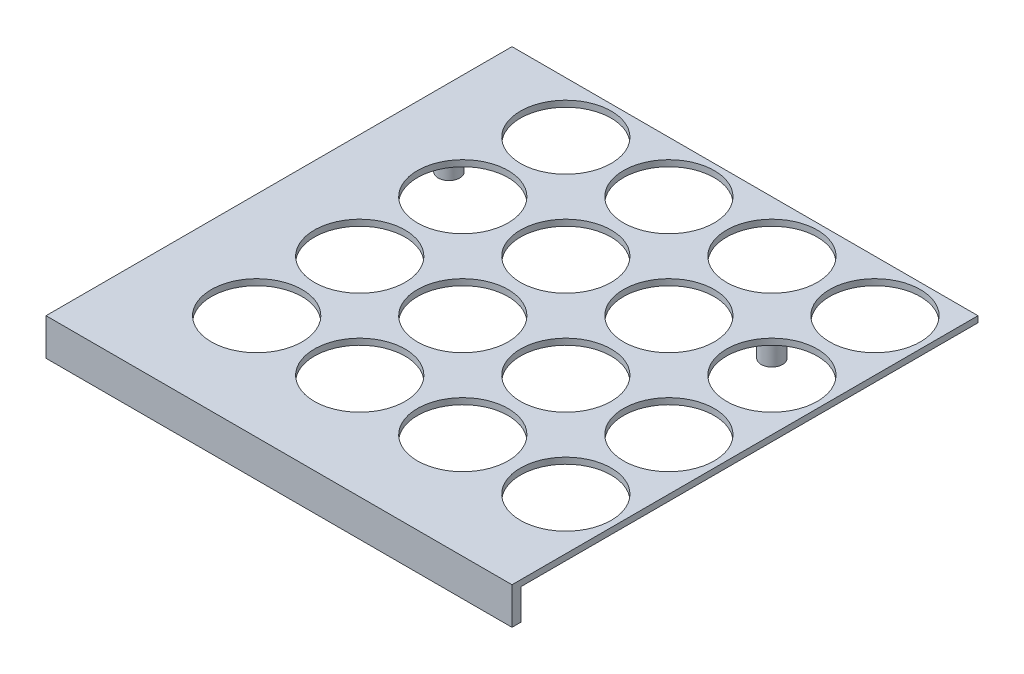
ISO-10303-21;
HEADER;
FILE_DESCRIPTION(('STEP AP214'),'2;1');
FILE_NAME('part.step','',(''),(''),'','','');
FILE_SCHEMA(('AUTOMOTIVE_DESIGN { 1 0 10303 214 1 1 1 1 }'));
ENDSEC;
DATA;
#1=APPLICATION_CONTEXT('core data for automotive mechanical design processes');
#2=APPLICATION_PROTOCOL_DEFINITION('international standard','automotive_design',2000,#1);
#3=PRODUCT_CONTEXT('',#1,'mechanical');
#4=PRODUCT('Part','Part','',(#3));
#5=PRODUCT_RELATED_PRODUCT_CATEGORY('part','',(#4));
#6=PRODUCT_DEFINITION_FORMATION('','',#4);
#7=PRODUCT_DEFINITION_CONTEXT('part definition',#1,'design');
#8=PRODUCT_DEFINITION('design','',#6,#7);
#9=PRODUCT_DEFINITION_SHAPE('','',#8);
#10=(LENGTH_UNIT() NAMED_UNIT(*) SI_UNIT(.MILLI.,.METRE.));
#11=(NAMED_UNIT(*) PLANE_ANGLE_UNIT() SI_UNIT($,.RADIAN.));
#12=(NAMED_UNIT(*) SI_UNIT($,.STERADIAN.) SOLID_ANGLE_UNIT());
#13=UNCERTAINTY_MEASURE_WITH_UNIT(LENGTH_MEASURE(1.E-05),#10,'distance_accuracy_value','');
#14=(GEOMETRIC_REPRESENTATION_CONTEXT(3) GLOBAL_UNCERTAINTY_ASSIGNED_CONTEXT((#13)) GLOBAL_UNIT_ASSIGNED_CONTEXT((#10,
#11,#12)) REPRESENTATION_CONTEXT('',''));
#15=CARTESIAN_POINT('',(0.,0.,0.));
#16=DIRECTION('',(0.,0.,1.));
#17=DIRECTION('',(1.,0.,0.));
#18=AXIS2_PLACEMENT_3D('',#15,#16,#17);
#19=CARTESIAN_POINT('',(134.75,2.,-134.75));
#20=DIRECTION('',(0.,-1.,0.));
#21=DIRECTION('',(0.,0.,-1.));
#22=AXIS2_PLACEMENT_3D('',#19,#20,#21);
#23=CYLINDRICAL_SURFACE('',#22,14.75);
#24=CARTESIAN_POINT('',(134.75,2.,-134.75));
#25=DIRECTION('',(0.,1.,0.));
#26=DIRECTION('',(0.,0.,1.));
#27=AXIS2_PLACEMENT_3D('',#24,#25,#26);
#28=CIRCLE('',#27,14.75);
#29=CARTESIAN_POINT('',(134.75,2.,-120.));
#30=VERTEX_POINT('',#29);
#31=EDGE_CURVE('E303',#30,#30,#28,.T.);
#32=ORIENTED_EDGE('',*,*,#31,.T.);
#33=EDGE_LOOP('',(#32));
#34=FACE_BOUND('',#33,.T.);
#35=CARTESIAN_POINT('',(134.75,0.,-134.75));
#36=DIRECTION('',(0.,1.,0.));
#37=DIRECTION('',(0.,0.,1.));
#38=AXIS2_PLACEMENT_3D('',#35,#36,#37);
#39=CIRCLE('',#38,14.75);
#40=CARTESIAN_POINT('',(134.75,0.,-120.));
#41=VERTEX_POINT('',#40);
#42=EDGE_CURVE('E153',#41,#41,#39,.T.);
#43=ORIENTED_EDGE('',*,*,#42,.F.);
#44=EDGE_LOOP('',(#43));
#45=FACE_BOUND('',#44,.T.);
#46=ADVANCED_FACE('F41',(#34,#45),#23,.F.);
#47=CARTESIAN_POINT('',(101.25,2.,-134.75));
#48=DIRECTION('',(0.,-1.,0.));
#49=DIRECTION('',(0.,0.,-1.));
#50=AXIS2_PLACEMENT_3D('',#47,#48,#49);
#51=CYLINDRICAL_SURFACE('',#50,14.75);
#52=CARTESIAN_POINT('',(101.25,2.,-134.75));
#53=DIRECTION('',(0.,1.,0.));
#54=DIRECTION('',(0.,0.,1.));
#55=AXIS2_PLACEMENT_3D('',#52,#53,#54);
#56=CIRCLE('',#55,14.75);
#57=CARTESIAN_POINT('',(101.25,2.,-120.));
#58=VERTEX_POINT('',#57);
#59=EDGE_CURVE('E295',#58,#58,#56,.T.);
#60=ORIENTED_EDGE('',*,*,#59,.T.);
#61=EDGE_LOOP('',(#60));
#62=FACE_BOUND('',#61,.T.);
#63=CARTESIAN_POINT('',(101.25,0.,-134.75));
#64=DIRECTION('',(0.,1.,0.));
#65=DIRECTION('',(0.,0.,1.));
#66=AXIS2_PLACEMENT_3D('',#63,#64,#65);
#67=CIRCLE('',#66,14.75);
#68=CARTESIAN_POINT('',(101.25,0.,-120.));
#69=VERTEX_POINT('',#68);
#70=EDGE_CURVE('E299',#69,#69,#67,.T.);
#71=ORIENTED_EDGE('',*,*,#70,.F.);
#72=EDGE_LOOP('',(#71));
#73=FACE_BOUND('',#72,.T.);
#74=ADVANCED_FACE('F369',(#62,#73),#51,.F.);
#75=CARTESIAN_POINT('',(67.75,2.,-134.75));
#76=DIRECTION('',(0.,-1.,0.));
#77=DIRECTION('',(0.,0.,-1.));
#78=AXIS2_PLACEMENT_3D('',#75,#76,#77);
#79=CYLINDRICAL_SURFACE('',#78,14.75);
#80=CARTESIAN_POINT('',(67.75,2.,-134.75));
#81=DIRECTION('',(0.,1.,0.));
#82=DIRECTION('',(0.,0.,1.));
#83=AXIS2_PLACEMENT_3D('',#80,#81,#82);
#84=CIRCLE('',#83,14.75);
#85=CARTESIAN_POINT('',(67.75,2.,-120.));
#86=VERTEX_POINT('',#85);
#87=EDGE_CURVE('E287',#86,#86,#84,.T.);
#88=ORIENTED_EDGE('',*,*,#87,.T.);
#89=EDGE_LOOP('',(#88));
#90=FACE_BOUND('',#89,.T.);
#91=CARTESIAN_POINT('',(67.75,0.,-134.75));
#92=DIRECTION('',(0.,1.,0.));
#93=DIRECTION('',(0.,0.,1.));
#94=AXIS2_PLACEMENT_3D('',#91,#92,#93);
#95=CIRCLE('',#94,14.75);
#96=CARTESIAN_POINT('',(67.75,0.,-120.));
#97=VERTEX_POINT('',#96);
#98=EDGE_CURVE('E291',#97,#97,#95,.T.);
#99=ORIENTED_EDGE('',*,*,#98,.F.);
#100=EDGE_LOOP('',(#99));
#101=FACE_BOUND('',#100,.T.);
#102=ADVANCED_FACE('F374',(#90,#101),#79,.F.);
#103=CARTESIAN_POINT('',(34.25,2.,-134.75));
#104=DIRECTION('',(0.,-1.,0.));
#105=DIRECTION('',(0.,0.,-1.));
#106=AXIS2_PLACEMENT_3D('',#103,#104,#105);
#107=CYLINDRICAL_SURFACE('',#106,14.75);
#108=CARTESIAN_POINT('',(34.25,2.,-134.75));
#109=DIRECTION('',(0.,1.,0.));
#110=DIRECTION('',(0.,0.,1.));
#111=AXIS2_PLACEMENT_3D('',#108,#109,#110);
#112=CIRCLE('',#111,14.75);
#113=CARTESIAN_POINT('',(34.25,2.,-120.));
#114=VERTEX_POINT('',#113);
#115=EDGE_CURVE('E279',#114,#114,#112,.T.);
#116=ORIENTED_EDGE('',*,*,#115,.T.);
#117=EDGE_LOOP('',(#116));
#118=FACE_BOUND('',#117,.T.);
#119=CARTESIAN_POINT('',(34.25,0.,-134.75));
#120=DIRECTION('',(0.,1.,0.));
#121=DIRECTION('',(0.,0.,1.));
#122=AXIS2_PLACEMENT_3D('',#119,#120,#121);
#123=CIRCLE('',#122,14.75);
#124=CARTESIAN_POINT('',(34.25,0.,-120.));
#125=VERTEX_POINT('',#124);
#126=EDGE_CURVE('E283',#125,#125,#123,.T.);
#127=ORIENTED_EDGE('',*,*,#126,.F.);
#128=EDGE_LOOP('',(#127));
#129=FACE_BOUND('',#128,.T.);
#130=ADVANCED_FACE('F448',(#118,#129),#107,.F.);
#131=CARTESIAN_POINT('',(134.75,2.,-101.25));
#132=DIRECTION('',(0.,-1.,0.));
#133=DIRECTION('',(0.,0.,-1.));
#134=AXIS2_PLACEMENT_3D('',#131,#132,#133);
#135=CYLINDRICAL_SURFACE('',#134,14.75);
#136=CARTESIAN_POINT('',(134.75,2.,-101.25));
#137=DIRECTION('',(0.,1.,0.));
#138=DIRECTION('',(0.,0.,1.));
#139=AXIS2_PLACEMENT_3D('',#136,#137,#138);
#140=CIRCLE('',#139,14.75);
#141=CARTESIAN_POINT('',(134.75,2.,-86.5));
#142=VERTEX_POINT('',#141);
#143=EDGE_CURVE('E271',#142,#142,#140,.T.);
#144=ORIENTED_EDGE('',*,*,#143,.T.);
#145=EDGE_LOOP('',(#144));
#146=FACE_BOUND('',#145,.T.);
#147=CARTESIAN_POINT('',(134.75,0.,-101.25));
#148=DIRECTION('',(0.,1.,0.));
#149=DIRECTION('',(0.,0.,1.));
#150=AXIS2_PLACEMENT_3D('',#147,#148,#149);
#151=CIRCLE('',#150,14.75);
#152=CARTESIAN_POINT('',(134.75,0.,-86.5));
#153=VERTEX_POINT('',#152);
#154=EDGE_CURVE('E275',#153,#153,#151,.T.);
#155=ORIENTED_EDGE('',*,*,#154,.F.);
#156=EDGE_LOOP('',(#155));
#157=FACE_BOUND('',#156,.T.);
#158=ADVANCED_FACE('F444',(#146,#157),#135,.F.);
#159=CARTESIAN_POINT('',(101.25,2.,-101.25));
#160=DIRECTION('',(0.,-1.,0.));
#161=DIRECTION('',(0.,0.,-1.));
#162=AXIS2_PLACEMENT_3D('',#159,#160,#161);
#163=CYLINDRICAL_SURFACE('',#162,14.75);
#164=CARTESIAN_POINT('',(101.25,2.,-101.25));
#165=DIRECTION('',(0.,1.,0.));
#166=DIRECTION('',(0.,0.,1.));
#167=AXIS2_PLACEMENT_3D('',#164,#165,#166);
#168=CIRCLE('',#167,14.75);
#169=CARTESIAN_POINT('',(101.25,2.,-86.5));
#170=VERTEX_POINT('',#169);
#171=EDGE_CURVE('E263',#170,#170,#168,.T.);
#172=ORIENTED_EDGE('',*,*,#171,.T.);
#173=EDGE_LOOP('',(#172));
#174=FACE_BOUND('',#173,.T.);
#175=CARTESIAN_POINT('',(101.25,0.,-101.25));
#176=DIRECTION('',(0.,1.,0.));
#177=DIRECTION('',(0.,0.,1.));
#178=AXIS2_PLACEMENT_3D('',#175,#176,#177);
#179=CIRCLE('',#178,14.75);
#180=CARTESIAN_POINT('',(101.25,0.,-86.5));
#181=VERTEX_POINT('',#180);
#182=EDGE_CURVE('E267',#181,#181,#179,.T.);
#183=ORIENTED_EDGE('',*,*,#182,.F.);
#184=EDGE_LOOP('',(#183));
#185=FACE_BOUND('',#184,.T.);
#186=ADVANCED_FACE('F440',(#174,#185),#163,.F.);
#187=CARTESIAN_POINT('',(67.75,2.,-101.25));
#188=DIRECTION('',(0.,-1.,0.));
#189=DIRECTION('',(0.,0.,-1.));
#190=AXIS2_PLACEMENT_3D('',#187,#188,#189);
#191=CYLINDRICAL_SURFACE('',#190,14.75);
#192=CARTESIAN_POINT('',(67.75,2.,-101.25));
#193=DIRECTION('',(0.,1.,0.));
#194=DIRECTION('',(0.,0.,1.));
#195=AXIS2_PLACEMENT_3D('',#192,#193,#194);
#196=CIRCLE('',#195,14.75);
#197=CARTESIAN_POINT('',(67.75,2.,-86.5));
#198=VERTEX_POINT('',#197);
#199=EDGE_CURVE('E255',#198,#198,#196,.T.);
#200=ORIENTED_EDGE('',*,*,#199,.T.);
#201=EDGE_LOOP('',(#200));
#202=FACE_BOUND('',#201,.T.);
#203=CARTESIAN_POINT('',(67.75,0.,-101.25));
#204=DIRECTION('',(0.,1.,0.));
#205=DIRECTION('',(0.,0.,1.));
#206=AXIS2_PLACEMENT_3D('',#203,#204,#205);
#207=CIRCLE('',#206,14.75);
#208=CARTESIAN_POINT('',(67.75,0.,-86.5));
#209=VERTEX_POINT('',#208);
#210=EDGE_CURVE('E259',#209,#209,#207,.T.);
#211=ORIENTED_EDGE('',*,*,#210,.F.);
#212=EDGE_LOOP('',(#211));
#213=FACE_BOUND('',#212,.T.);
#214=ADVANCED_FACE('F436',(#202,#213),#191,.F.);
#215=CARTESIAN_POINT('',(34.25,2.,-101.25));
#216=DIRECTION('',(0.,-1.,0.));
#217=DIRECTION('',(0.,0.,-1.));
#218=AXIS2_PLACEMENT_3D('',#215,#216,#217);
#219=CYLINDRICAL_SURFACE('',#218,14.75);
#220=CARTESIAN_POINT('',(34.25,2.,-101.25));
#221=DIRECTION('',(0.,1.,0.));
#222=DIRECTION('',(0.,0.,1.));
#223=AXIS2_PLACEMENT_3D('',#220,#221,#222);
#224=CIRCLE('',#223,14.75);
#225=CARTESIAN_POINT('',(34.25,2.,-86.5));
#226=VERTEX_POINT('',#225);
#227=EDGE_CURVE('E247',#226,#226,#224,.T.);
#228=ORIENTED_EDGE('',*,*,#227,.T.);
#229=EDGE_LOOP('',(#228));
#230=FACE_BOUND('',#229,.T.);
#231=CARTESIAN_POINT('',(34.25,0.,-101.25));
#232=DIRECTION('',(0.,1.,0.));
#233=DIRECTION('',(0.,0.,1.));
#234=AXIS2_PLACEMENT_3D('',#231,#232,#233);
#235=CIRCLE('',#234,14.75);
#236=CARTESIAN_POINT('',(34.25,0.,-86.5));
#237=VERTEX_POINT('',#236);
#238=EDGE_CURVE('E251',#237,#237,#235,.T.);
#239=ORIENTED_EDGE('',*,*,#238,.F.);
#240=EDGE_LOOP('',(#239));
#241=FACE_BOUND('',#240,.T.);
#242=ADVANCED_FACE('F432',(#230,#241),#219,.F.);
#243=CARTESIAN_POINT('',(134.75,2.,-67.75));
#244=DIRECTION('',(0.,-1.,0.));
#245=DIRECTION('',(0.,0.,-1.));
#246=AXIS2_PLACEMENT_3D('',#243,#244,#245);
#247=CYLINDRICAL_SURFACE('',#246,14.75);
#248=CARTESIAN_POINT('',(134.75,2.,-67.75));
#249=DIRECTION('',(0.,1.,0.));
#250=DIRECTION('',(0.,0.,1.));
#251=AXIS2_PLACEMENT_3D('',#248,#249,#250);
#252=CIRCLE('',#251,14.75);
#253=CARTESIAN_POINT('',(134.75,2.,-53.));
#254=VERTEX_POINT('',#253);
#255=EDGE_CURVE('E239',#254,#254,#252,.T.);
#256=ORIENTED_EDGE('',*,*,#255,.T.);
#257=EDGE_LOOP('',(#256));
#258=FACE_BOUND('',#257,.T.);
#259=CARTESIAN_POINT('',(134.75,0.,-67.75));
#260=DIRECTION('',(0.,1.,0.));
#261=DIRECTION('',(0.,0.,1.));
#262=AXIS2_PLACEMENT_3D('',#259,#260,#261);
#263=CIRCLE('',#262,14.75);
#264=CARTESIAN_POINT('',(134.75,0.,-53.));
#265=VERTEX_POINT('',#264);
#266=EDGE_CURVE('E243',#265,#265,#263,.T.);
#267=ORIENTED_EDGE('',*,*,#266,.F.);
#268=EDGE_LOOP('',(#267));
#269=FACE_BOUND('',#268,.T.);
#270=ADVANCED_FACE('F428',(#258,#269),#247,.F.);
#271=CARTESIAN_POINT('',(101.25,2.,-67.75));
#272=DIRECTION('',(0.,-1.,0.));
#273=DIRECTION('',(0.,0.,-1.));
#274=AXIS2_PLACEMENT_3D('',#271,#272,#273);
#275=CYLINDRICAL_SURFACE('',#274,14.75);
#276=CARTESIAN_POINT('',(101.25,2.,-67.75));
#277=DIRECTION('',(0.,1.,0.));
#278=DIRECTION('',(0.,0.,1.));
#279=AXIS2_PLACEMENT_3D('',#276,#277,#278);
#280=CIRCLE('',#279,14.75);
#281=CARTESIAN_POINT('',(101.25,2.,-53.));
#282=VERTEX_POINT('',#281);
#283=EDGE_CURVE('E231',#282,#282,#280,.T.);
#284=ORIENTED_EDGE('',*,*,#283,.T.);
#285=EDGE_LOOP('',(#284));
#286=FACE_BOUND('',#285,.T.);
#287=CARTESIAN_POINT('',(101.25,0.,-67.75));
#288=DIRECTION('',(0.,1.,0.));
#289=DIRECTION('',(0.,0.,1.));
#290=AXIS2_PLACEMENT_3D('',#287,#288,#289);
#291=CIRCLE('',#290,14.75);
#292=CARTESIAN_POINT('',(101.25,0.,-53.));
#293=VERTEX_POINT('',#292);
#294=EDGE_CURVE('E235',#293,#293,#291,.T.);
#295=ORIENTED_EDGE('',*,*,#294,.F.);
#296=EDGE_LOOP('',(#295));
#297=FACE_BOUND('',#296,.T.);
#298=ADVANCED_FACE('F424',(#286,#297),#275,.F.);
#299=CARTESIAN_POINT('',(67.75,2.,-67.75));
#300=DIRECTION('',(0.,-1.,0.));
#301=DIRECTION('',(0.,0.,-1.));
#302=AXIS2_PLACEMENT_3D('',#299,#300,#301);
#303=CYLINDRICAL_SURFACE('',#302,14.75);
#304=CARTESIAN_POINT('',(67.75,2.,-67.75));
#305=DIRECTION('',(0.,1.,0.));
#306=DIRECTION('',(0.,0.,1.));
#307=AXIS2_PLACEMENT_3D('',#304,#305,#306);
#308=CIRCLE('',#307,14.75);
#309=CARTESIAN_POINT('',(67.75,2.,-53.));
#310=VERTEX_POINT('',#309);
#311=EDGE_CURVE('E223',#310,#310,#308,.T.);
#312=ORIENTED_EDGE('',*,*,#311,.T.);
#313=EDGE_LOOP('',(#312));
#314=FACE_BOUND('',#313,.T.);
#315=CARTESIAN_POINT('',(67.75,0.,-67.75));
#316=DIRECTION('',(0.,1.,0.));
#317=DIRECTION('',(0.,0.,1.));
#318=AXIS2_PLACEMENT_3D('',#315,#316,#317);
#319=CIRCLE('',#318,14.75);
#320=CARTESIAN_POINT('',(67.75,0.,-53.));
#321=VERTEX_POINT('',#320);
#322=EDGE_CURVE('E227',#321,#321,#319,.T.);
#323=ORIENTED_EDGE('',*,*,#322,.F.);
#324=EDGE_LOOP('',(#323));
#325=FACE_BOUND('',#324,.T.);
#326=ADVANCED_FACE('F420',(#314,#325),#303,.F.);
#327=CARTESIAN_POINT('',(34.25,2.,-67.75));
#328=DIRECTION('',(0.,-1.,0.));
#329=DIRECTION('',(0.,0.,-1.));
#330=AXIS2_PLACEMENT_3D('',#327,#328,#329);
#331=CYLINDRICAL_SURFACE('',#330,14.75);
#332=CARTESIAN_POINT('',(34.25,2.,-67.75));
#333=DIRECTION('',(0.,1.,0.));
#334=DIRECTION('',(0.,0.,1.));
#335=AXIS2_PLACEMENT_3D('',#332,#333,#334);
#336=CIRCLE('',#335,14.75);
#337=CARTESIAN_POINT('',(34.25,2.,-53.));
#338=VERTEX_POINT('',#337);
#339=EDGE_CURVE('E215',#338,#338,#336,.T.);
#340=ORIENTED_EDGE('',*,*,#339,.T.);
#341=EDGE_LOOP('',(#340));
#342=FACE_BOUND('',#341,.T.);
#343=CARTESIAN_POINT('',(34.25,0.,-67.75));
#344=DIRECTION('',(0.,1.,0.));
#345=DIRECTION('',(0.,0.,1.));
#346=AXIS2_PLACEMENT_3D('',#343,#344,#345);
#347=CIRCLE('',#346,14.75);
#348=CARTESIAN_POINT('',(34.25,0.,-53.));
#349=VERTEX_POINT('',#348);
#350=EDGE_CURVE('E219',#349,#349,#347,.T.);
#351=ORIENTED_EDGE('',*,*,#350,.F.);
#352=EDGE_LOOP('',(#351));
#353=FACE_BOUND('',#352,.T.);
#354=ADVANCED_FACE('F416',(#342,#353),#331,.F.);
#355=CARTESIAN_POINT('',(134.75,2.,-34.25));
#356=DIRECTION('',(0.,-1.,0.));
#357=DIRECTION('',(0.,0.,-1.));
#358=AXIS2_PLACEMENT_3D('',#355,#356,#357);
#359=CYLINDRICAL_SURFACE('',#358,14.75);
#360=CARTESIAN_POINT('',(134.75,2.,-34.25));
#361=DIRECTION('',(0.,1.,0.));
#362=DIRECTION('',(0.,0.,1.));
#363=AXIS2_PLACEMENT_3D('',#360,#361,#362);
#364=CIRCLE('',#363,14.75);
#365=CARTESIAN_POINT('',(134.75,2.,-19.5));
#366=VERTEX_POINT('',#365);
#367=EDGE_CURVE('E207',#366,#366,#364,.T.);
#368=ORIENTED_EDGE('',*,*,#367,.T.);
#369=EDGE_LOOP('',(#368));
#370=FACE_BOUND('',#369,.T.);
#371=CARTESIAN_POINT('',(134.75,0.,-34.25));
#372=DIRECTION('',(0.,1.,0.));
#373=DIRECTION('',(0.,0.,1.));
#374=AXIS2_PLACEMENT_3D('',#371,#372,#373);
#375=CIRCLE('',#374,14.75);
#376=CARTESIAN_POINT('',(134.75,0.,-19.5));
#377=VERTEX_POINT('',#376);
#378=EDGE_CURVE('E211',#377,#377,#375,.T.);
#379=ORIENTED_EDGE('',*,*,#378,.F.);
#380=EDGE_LOOP('',(#379));
#381=FACE_BOUND('',#380,.T.);
#382=ADVANCED_FACE('F412',(#370,#381),#359,.F.);
#383=CARTESIAN_POINT('',(101.25,2.,-34.25));
#384=DIRECTION('',(0.,-1.,0.));
#385=DIRECTION('',(0.,0.,-1.));
#386=AXIS2_PLACEMENT_3D('',#383,#384,#385);
#387=CYLINDRICAL_SURFACE('',#386,14.75);
#388=CARTESIAN_POINT('',(101.25,2.,-34.25));
#389=DIRECTION('',(0.,1.,0.));
#390=DIRECTION('',(0.,0.,1.));
#391=AXIS2_PLACEMENT_3D('',#388,#389,#390);
#392=CIRCLE('',#391,14.75);
#393=CARTESIAN_POINT('',(101.25,2.,-19.5));
#394=VERTEX_POINT('',#393);
#395=EDGE_CURVE('E203',#394,#394,#392,.T.);
#396=ORIENTED_EDGE('',*,*,#395,.T.);
#397=EDGE_LOOP('',(#396));
#398=FACE_BOUND('',#397,.T.);
#399=CARTESIAN_POINT('',(101.25,0.,-34.25));
#400=DIRECTION('',(0.,1.,0.));
#401=DIRECTION('',(0.,0.,1.));
#402=AXIS2_PLACEMENT_3D('',#399,#400,#401);
#403=CIRCLE('',#402,14.75);
#404=CARTESIAN_POINT('',(101.25,0.,-19.5));
#405=VERTEX_POINT('',#404);
#406=EDGE_CURVE('E178',#405,#405,#403,.T.);
#407=ORIENTED_EDGE('',*,*,#406,.F.);
#408=EDGE_LOOP('',(#407));
#409=FACE_BOUND('',#408,.T.);
#410=ADVANCED_FACE('F408',(#398,#409),#387,.F.);
#411=CARTESIAN_POINT('',(0.,2.,0.));
#412=DIRECTION('',(1.,0.,0.));
#413=DIRECTION('',(0.,0.,-1.));
#414=AXIS2_PLACEMENT_3D('',#411,#412,#413);
#415=PLANE('',#414);
#416=DIRECTION('',(0.,-1.,0.));
#417=VECTOR('',#416,1.);
#418=CARTESIAN_POINT('',(0.,2.,-151.5));
#419=LINE('',#418,#417);
#420=CARTESIAN_POINT('',(0.,2.,-151.5));
#421=VERTEX_POINT('',#420);
#422=CARTESIAN_POINT('',(0.,-10.,-151.5));
#423=VERTEX_POINT('',#422);
#424=EDGE_CURVE('E189',#421,#423,#419,.T.);
#425=ORIENTED_EDGE('',*,*,#424,.T.);
#426=DIRECTION('',(0.,0.,1.));
#427=VECTOR('',#426,1.);
#428=CARTESIAN_POINT('',(0.,-10.,-151.5));
#429=LINE('',#428,#427);
#430=CARTESIAN_POINT('',(0.,-10.,0.));
#431=VERTEX_POINT('',#430);
#432=EDGE_CURVE('E148',#423,#431,#429,.T.);
#433=ORIENTED_EDGE('',*,*,#432,.T.);
#434=DIRECTION('',(0.,-1.,0.));
#435=VECTOR('',#434,1.);
#436=CARTESIAN_POINT('',(0.,2.,0.));
#437=LINE('',#436,#435);
#438=CARTESIAN_POINT('',(0.,2.,0.));
#439=VERTEX_POINT('',#438);
#440=EDGE_CURVE('E200',#439,#431,#437,.T.);
#441=ORIENTED_EDGE('',*,*,#440,.F.);
#442=DIRECTION('',(0.,0.,1.));
#443=VECTOR('',#442,1.);
#444=CARTESIAN_POINT('',(0.,2.,0.));
#445=LINE('',#444,#443);
#446=EDGE_CURVE('E174',#421,#439,#445,.T.);
#447=ORIENTED_EDGE('',*,*,#446,.F.);
#448=EDGE_LOOP('',(#425,#433,#441,#447));
#449=FACE_BOUND('',#448,.T.);
#450=ADVANCED_FACE('F404',(#449),#415,.F.);
#451=CARTESIAN_POINT('',(0.,2.,0.));
#452=DIRECTION('',(0.,0.,-1.));
#453=DIRECTION('',(-1.,0.,0.));
#454=AXIS2_PLACEMENT_3D('',#451,#452,#453);
#455=PLANE('',#454);
#456=ORIENTED_EDGE('',*,*,#440,.T.);
#457=DIRECTION('',(1.,0.,0.));
#458=VECTOR('',#457,1.);
#459=CARTESIAN_POINT('',(0.,-10.,0.));
#460=LINE('',#459,#458);
#461=CARTESIAN_POINT('',(151.5,-10.,0.));
#462=VERTEX_POINT('',#461);
#463=EDGE_CURVE('E152',#431,#462,#460,.T.);
#464=ORIENTED_EDGE('',*,*,#463,.T.);
#465=DIRECTION('',(0.,-1.,0.));
#466=VECTOR('',#465,1.);
#467=CARTESIAN_POINT('',(151.5,2.,0.));
#468=LINE('',#467,#466);
#469=CARTESIAN_POINT('',(151.5,2.,0.));
#470=VERTEX_POINT('',#469);
#471=EDGE_CURVE('E197',#470,#462,#468,.T.);
#472=ORIENTED_EDGE('',*,*,#471,.F.);
#473=DIRECTION('',(1.,0.,0.));
#474=VECTOR('',#473,1.);
#475=CARTESIAN_POINT('',(0.,2.,0.));
#476=LINE('',#475,#474);
#477=EDGE_CURVE('E181',#439,#470,#476,.T.);
#478=ORIENTED_EDGE('',*,*,#477,.F.);
#479=EDGE_LOOP('',(#456,#464,#472,#478));
#480=FACE_BOUND('',#479,.T.);
#481=ADVANCED_FACE('F400',(#480),#455,.F.);
#482=CARTESIAN_POINT('',(151.5,2.,0.));
#483=DIRECTION('',(-1.,0.,0.));
#484=DIRECTION('',(0.,0.,1.));
#485=AXIS2_PLACEMENT_3D('',#482,#483,#484);
#486=PLANE('',#485);
#487=DIRECTION('',(0.,0.,-1.));
#488=VECTOR('',#487,1.);
#489=CARTESIAN_POINT('',(151.5,-10.,-151.5));
#490=LINE('',#489,#488);
#491=CARTESIAN_POINT('',(151.5,-10.,-3.));
#492=VERTEX_POINT('',#491);
#493=EDGE_CURVE('E157',#462,#492,#490,.T.);
#494=ORIENTED_EDGE('',*,*,#493,.T.);
#495=DIRECTION('',(0.,1.,0.));
#496=VECTOR('',#495,1.);
#497=CARTESIAN_POINT('',(151.5,-10.,-3.));
#498=LINE('',#497,#496);
#499=CARTESIAN_POINT('',(151.5,0.,-3.));
#500=VERTEX_POINT('',#499);
#501=EDGE_CURVE('E56',#492,#500,#498,.T.);
#502=ORIENTED_EDGE('',*,*,#501,.T.);
#503=DIRECTION('',(0.,0.,-1.));
#504=VECTOR('',#503,1.);
#505=CARTESIAN_POINT('',(151.5,0.,-3.));
#506=LINE('',#505,#504);
#507=CARTESIAN_POINT('',(151.5,0.,-151.5));
#508=VERTEX_POINT('',#507);
#509=EDGE_CURVE('E128',#500,#508,#506,.T.);
#510=ORIENTED_EDGE('',*,*,#509,.T.);
#511=DIRECTION('',(0.,-1.,0.));
#512=VECTOR('',#511,1.);
#513=CARTESIAN_POINT('',(151.5,2.,-151.5));
#514=LINE('',#513,#512);
#515=CARTESIAN_POINT('',(151.5,2.,-151.5));
#516=VERTEX_POINT('',#515);
#517=EDGE_CURVE('E193',#516,#508,#514,.T.);
#518=ORIENTED_EDGE('',*,*,#517,.F.);
#519=DIRECTION('',(0.,0.,-1.));
#520=VECTOR('',#519,1.);
#521=CARTESIAN_POINT('',(151.5,2.,0.));
#522=LINE('',#521,#520);
#523=EDGE_CURVE('E184',#470,#516,#522,.T.);
#524=ORIENTED_EDGE('',*,*,#523,.F.);
#525=ORIENTED_EDGE('',*,*,#471,.T.);
#526=EDGE_LOOP('',(#494,#502,#510,#518,#524,#525));
#527=FACE_BOUND('',#526,.T.);
#528=ADVANCED_FACE('F391',(#527),#486,.F.);
#529=CARTESIAN_POINT('',(0.,2.,-151.5));
#530=DIRECTION('',(0.,0.,1.));
#531=DIRECTION('',(1.,0.,0.));
#532=AXIS2_PLACEMENT_3D('',#529,#530,#531);
#533=PLANE('',#532);
#534=DIRECTION('',(-1.,0.,0.));
#535=VECTOR('',#534,1.);
#536=CARTESIAN_POINT('',(3.,0.,-151.5));
#537=LINE('',#536,#535);
#538=CARTESIAN_POINT('',(3.,0.,-151.5));
#539=VERTEX_POINT('',#538);
#540=EDGE_CURVE('E124',#508,#539,#537,.T.);
#541=ORIENTED_EDGE('',*,*,#540,.T.);
#542=DIRECTION('',(0.,1.,0.));
#543=VECTOR('',#542,1.);
#544=CARTESIAN_POINT('',(3.,-10.,-151.5));
#545=LINE('',#544,#543);
#546=CARTESIAN_POINT('',(3.,-10.,-151.5));
#547=VERTEX_POINT('',#546);
#548=EDGE_CURVE('E142',#547,#539,#545,.T.);
#549=ORIENTED_EDGE('',*,*,#548,.F.);
#550=DIRECTION('',(-1.,0.,0.));
#551=VECTOR('',#550,1.);
#552=CARTESIAN_POINT('',(0.,-10.,-151.5));
#553=LINE('',#552,#551);
#554=EDGE_CURVE('E122',#547,#423,#553,.T.);
#555=ORIENTED_EDGE('',*,*,#554,.T.);
#556=ORIENTED_EDGE('',*,*,#424,.F.);
#557=DIRECTION('',(-1.,0.,0.));
#558=VECTOR('',#557,1.);
#559=CARTESIAN_POINT('',(0.,2.,-151.5));
#560=LINE('',#559,#558);
#561=EDGE_CURVE('E64',#516,#421,#560,.T.);
#562=ORIENTED_EDGE('',*,*,#561,.F.);
#563=ORIENTED_EDGE('',*,*,#517,.T.);
#564=EDGE_LOOP('',(#541,#549,#555,#556,#562,#563));
#565=FACE_BOUND('',#564,.T.);
#566=ADVANCED_FACE('F381',(#565),#533,.F.);
#567=CARTESIAN_POINT('',(0.,2.,0.));
#568=DIRECTION('',(0.,-1.,0.));
#569=DIRECTION('',(0.,0.,-1.));
#570=AXIS2_PLACEMENT_3D('',#567,#568,#569);
#571=PLANE('',#570);
#572=CARTESIAN_POINT('',(67.75,2.,-34.25));
#573=DIRECTION('',(0.,1.,0.));
#574=DIRECTION('',(0.,0.,1.));
#575=AXIS2_PLACEMENT_3D('',#572,#573,#574);
#576=CIRCLE('',#575,14.75);
#577=CARTESIAN_POINT('',(67.75,2.,-19.5));
#578=VERTEX_POINT('',#577);
#579=EDGE_CURVE('E162',#578,#578,#576,.T.);
#580=ORIENTED_EDGE('',*,*,#579,.F.);
#581=EDGE_LOOP('',(#580));
#582=FACE_BOUND('',#581,.T.);
#583=CARTESIAN_POINT('',(34.25,2.,-34.25));
#584=DIRECTION('',(0.,1.,0.));
#585=DIRECTION('',(0.,0.,1.));
#586=AXIS2_PLACEMENT_3D('',#583,#584,#585);
#587=CIRCLE('',#586,14.75);
#588=CARTESIAN_POINT('',(34.25,2.,-19.5));
#589=VERTEX_POINT('',#588);
#590=EDGE_CURVE('E166',#589,#589,#587,.T.);
#591=ORIENTED_EDGE('',*,*,#590,.F.);
#592=EDGE_LOOP('',(#591));
#593=FACE_BOUND('',#592,.T.);
#594=ORIENTED_EDGE('',*,*,#446,.T.);
#595=ORIENTED_EDGE('',*,*,#477,.T.);
#596=ORIENTED_EDGE('',*,*,#523,.T.);
#597=ORIENTED_EDGE('',*,*,#561,.T.);
#598=EDGE_LOOP('',(#594,#595,#596,#597));
#599=FACE_BOUND('',#598,.T.);
#600=ORIENTED_EDGE('',*,*,#395,.F.);
#601=EDGE_LOOP('',(#600));
#602=FACE_BOUND('',#601,.T.);
#603=ORIENTED_EDGE('',*,*,#367,.F.);
#604=EDGE_LOOP('',(#603));
#605=FACE_BOUND('',#604,.T.);
#606=ORIENTED_EDGE('',*,*,#339,.F.);
#607=EDGE_LOOP('',(#606));
#608=FACE_BOUND('',#607,.T.);
#609=ORIENTED_EDGE('',*,*,#311,.F.);
#610=EDGE_LOOP('',(#609));
#611=FACE_BOUND('',#610,.T.);
#612=ORIENTED_EDGE('',*,*,#283,.F.);
#613=EDGE_LOOP('',(#612));
#614=FACE_BOUND('',#613,.T.);
#615=ORIENTED_EDGE('',*,*,#255,.F.);
#616=EDGE_LOOP('',(#615));
#617=FACE_BOUND('',#616,.T.);
#618=ORIENTED_EDGE('',*,*,#227,.F.);
#619=EDGE_LOOP('',(#618));
#620=FACE_BOUND('',#619,.T.);
#621=ORIENTED_EDGE('',*,*,#199,.F.);
#622=EDGE_LOOP('',(#621));
#623=FACE_BOUND('',#622,.T.);
#624=ORIENTED_EDGE('',*,*,#171,.F.);
#625=EDGE_LOOP('',(#624));
#626=FACE_BOUND('',#625,.T.);
#627=ORIENTED_EDGE('',*,*,#143,.F.);
#628=EDGE_LOOP('',(#627));
#629=FACE_BOUND('',#628,.T.);
#630=ORIENTED_EDGE('',*,*,#115,.F.);
#631=EDGE_LOOP('',(#630));
#632=FACE_BOUND('',#631,.T.);
#633=ORIENTED_EDGE('',*,*,#87,.F.);
#634=EDGE_LOOP('',(#633));
#635=FACE_BOUND('',#634,.T.);
#636=ORIENTED_EDGE('',*,*,#59,.F.);
#637=EDGE_LOOP('',(#636));
#638=FACE_BOUND('',#637,.T.);
#639=ORIENTED_EDGE('',*,*,#31,.F.);
#640=EDGE_LOOP('',(#639));
#641=FACE_BOUND('',#640,.T.);
#642=ADVANCED_FACE('F378',(#582,#593,#599,#602,#605,#608,#611,#614,#617,#620,#623,#626,#629,
#632,#635,#638,#641),#571,.F.);
#643=CARTESIAN_POINT('',(34.25,2.,-34.25));
#644=DIRECTION('',(0.,-1.,0.));
#645=DIRECTION('',(0.,0.,-1.));
#646=AXIS2_PLACEMENT_3D('',#643,#644,#645);
#647=CYLINDRICAL_SURFACE('',#646,14.75);
#648=ORIENTED_EDGE('',*,*,#590,.T.);
#649=EDGE_LOOP('',(#648));
#650=FACE_BOUND('',#649,.T.);
#651=CARTESIAN_POINT('',(34.25,0.,-34.25));
#652=DIRECTION('',(0.,1.,0.));
#653=DIRECTION('',(0.,0.,1.));
#654=AXIS2_PLACEMENT_3D('',#651,#652,#653);
#655=CIRCLE('',#654,14.75);
#656=CARTESIAN_POINT('',(34.25,0.,-19.5));
#657=VERTEX_POINT('',#656);
#658=EDGE_CURVE('E170',#657,#657,#655,.T.);
#659=ORIENTED_EDGE('',*,*,#658,.F.);
#660=EDGE_LOOP('',(#659));
#661=FACE_BOUND('',#660,.T.);
#662=ADVANCED_FACE('F380',(#650,#661),#647,.F.);
#663=CARTESIAN_POINT('',(67.75,2.,-34.25));
#664=DIRECTION('',(0.,-1.,0.));
#665=DIRECTION('',(0.,0.,-1.));
#666=AXIS2_PLACEMENT_3D('',#663,#664,#665);
#667=CYLINDRICAL_SURFACE('',#666,14.75);
#668=ORIENTED_EDGE('',*,*,#579,.T.);
#669=EDGE_LOOP('',(#668));
#670=FACE_BOUND('',#669,.T.);
#671=CARTESIAN_POINT('',(67.75,0.,-34.25));
#672=DIRECTION('',(0.,1.,0.));
#673=DIRECTION('',(0.,0.,1.));
#674=AXIS2_PLACEMENT_3D('',#671,#672,#673);
#675=CIRCLE('',#674,14.75);
#676=CARTESIAN_POINT('',(67.75,0.,-19.5));
#677=VERTEX_POINT('',#676);
#678=EDGE_CURVE('E145',#677,#677,#675,.T.);
#679=ORIENTED_EDGE('',*,*,#678,.F.);
#680=EDGE_LOOP('',(#679));
#681=FACE_BOUND('',#680,.T.);
#682=ADVANCED_FACE('F388',(#670,#681),#667,.F.);
#683=CARTESIAN_POINT('',(0.,-10.,0.));
#684=DIRECTION('',(0.,1.,0.));
#685=DIRECTION('',(0.,0.,1.));
#686=AXIS2_PLACEMENT_3D('',#683,#684,#685);
#687=PLANE('',#686);
#688=ORIENTED_EDGE('',*,*,#554,.F.);
#689=DIRECTION('',(0.,0.,1.));
#690=VECTOR('',#689,1.);
#691=CARTESIAN_POINT('',(3.,-10.,-3.));
#692=LINE('',#691,#690);
#693=CARTESIAN_POINT('',(3.,-10.,-3.));
#694=VERTEX_POINT('',#693);
#695=EDGE_CURVE('E105',#547,#694,#692,.T.);
#696=ORIENTED_EDGE('',*,*,#695,.T.);
#697=DIRECTION('',(1.,0.,0.));
#698=VECTOR('',#697,1.);
#699=CARTESIAN_POINT('',(3.,-10.,-3.));
#700=LINE('',#699,#698);
#701=EDGE_CURVE('E111',#694,#492,#700,.T.);
#702=ORIENTED_EDGE('',*,*,#701,.T.);
#703=ORIENTED_EDGE('',*,*,#493,.F.);
#704=ORIENTED_EDGE('',*,*,#463,.F.);
#705=ORIENTED_EDGE('',*,*,#432,.F.);
#706=EDGE_LOOP('',(#688,#696,#702,#703,#704,#705));
#707=FACE_BOUND('',#706,.T.);
#708=ADVANCED_FACE('F120',(#707),#687,.F.);
#709=CARTESIAN_POINT('',(0.,0.,0.));
#710=DIRECTION('',(0.,-1.,0.));
#711=DIRECTION('',(0.,0.,-1.));
#712=AXIS2_PLACEMENT_3D('',#709,#710,#711);
#713=PLANE('',#712);
#714=CARTESIAN_POINT('',(118.,0.,-118.));
#715=DIRECTION('',(0.,-1.,0.));
#716=DIRECTION('',(0.,0.,-1.));
#717=AXIS2_PLACEMENT_3D('',#714,#715,#716);
#718=CIRCLE('',#717,3.5);
#719=CARTESIAN_POINT('',(118.,0.,-121.5));
#720=VERTEX_POINT('',#719);
#721=EDGE_CURVE('E11',#720,#720,#718,.T.);
#722=ORIENTED_EDGE('',*,*,#721,.F.);
#723=EDGE_LOOP('',(#722));
#724=FACE_BOUND('',#723,.T.);
#725=CARTESIAN_POINT('',(13.,0.,-118.));
#726=DIRECTION('',(0.,-1.,0.));
#727=DIRECTION('',(0.,0.,-1.));
#728=AXIS2_PLACEMENT_3D('',#725,#726,#727);
#729=CIRCLE('',#728,3.5);
#730=CARTESIAN_POINT('',(13.,0.,-121.5));
#731=VERTEX_POINT('',#730);
#732=EDGE_CURVE('E49',#731,#731,#729,.T.);
#733=ORIENTED_EDGE('',*,*,#732,.F.);
#734=EDGE_LOOP('',(#733));
#735=FACE_BOUND('',#734,.T.);
#736=CARTESIAN_POINT('',(118.,0.,-13.));
#737=DIRECTION('',(0.,-1.,0.));
#738=DIRECTION('',(0.,0.,-1.));
#739=AXIS2_PLACEMENT_3D('',#736,#737,#738);
#740=CIRCLE('',#739,3.5);
#741=CARTESIAN_POINT('',(118.,0.,-16.5));
#742=VERTEX_POINT('',#741);
#743=EDGE_CURVE('E317',#742,#742,#740,.T.);
#744=ORIENTED_EDGE('',*,*,#743,.F.);
#745=EDGE_LOOP('',(#744));
#746=FACE_BOUND('',#745,.T.);
#747=CARTESIAN_POINT('',(13.,0.,-13.));
#748=DIRECTION('',(0.,-1.,0.));
#749=DIRECTION('',(0.,0.,-1.));
#750=AXIS2_PLACEMENT_3D('',#747,#748,#749);
#751=CIRCLE('',#750,3.5);
#752=CARTESIAN_POINT('',(13.,0.,-16.5));
#753=VERTEX_POINT('',#752);
#754=EDGE_CURVE('E310',#753,#753,#751,.T.);
#755=ORIENTED_EDGE('',*,*,#754,.F.);
#756=EDGE_LOOP('',(#755));
#757=FACE_BOUND('',#756,.T.);
#758=DIRECTION('',(0.,0.,1.));
#759=VECTOR('',#758,1.);
#760=CARTESIAN_POINT('',(3.,0.,-3.));
#761=LINE('',#760,#759);
#762=CARTESIAN_POINT('',(3.,0.,-3.));
#763=VERTEX_POINT('',#762);
#764=EDGE_CURVE('E108',#539,#763,#761,.T.);
#765=ORIENTED_EDGE('',*,*,#764,.F.);
#766=ORIENTED_EDGE('',*,*,#540,.F.);
#767=ORIENTED_EDGE('',*,*,#509,.F.);
#768=DIRECTION('',(1.,0.,0.));
#769=VECTOR('',#768,1.);
#770=CARTESIAN_POINT('',(3.,0.,-3.));
#771=LINE('',#770,#769);
#772=EDGE_CURVE('E136',#763,#500,#771,.T.);
#773=ORIENTED_EDGE('',*,*,#772,.F.);
#774=EDGE_LOOP('',(#765,#766,#767,#773));
#775=FACE_BOUND('',#774,.T.);
#776=ORIENTED_EDGE('',*,*,#678,.T.);
#777=EDGE_LOOP('',(#776));
#778=FACE_BOUND('',#777,.T.);
#779=ORIENTED_EDGE('',*,*,#658,.T.);
#780=EDGE_LOOP('',(#779));
#781=FACE_BOUND('',#780,.T.);
#782=ORIENTED_EDGE('',*,*,#406,.T.);
#783=EDGE_LOOP('',(#782));
#784=FACE_BOUND('',#783,.T.);
#785=ORIENTED_EDGE('',*,*,#378,.T.);
#786=EDGE_LOOP('',(#785));
#787=FACE_BOUND('',#786,.T.);
#788=ORIENTED_EDGE('',*,*,#350,.T.);
#789=EDGE_LOOP('',(#788));
#790=FACE_BOUND('',#789,.T.);
#791=ORIENTED_EDGE('',*,*,#322,.T.);
#792=EDGE_LOOP('',(#791));
#793=FACE_BOUND('',#792,.T.);
#794=ORIENTED_EDGE('',*,*,#294,.T.);
#795=EDGE_LOOP('',(#794));
#796=FACE_BOUND('',#795,.T.);
#797=ORIENTED_EDGE('',*,*,#266,.T.);
#798=EDGE_LOOP('',(#797));
#799=FACE_BOUND('',#798,.T.);
#800=ORIENTED_EDGE('',*,*,#238,.T.);
#801=EDGE_LOOP('',(#800));
#802=FACE_BOUND('',#801,.T.);
#803=ORIENTED_EDGE('',*,*,#210,.T.);
#804=EDGE_LOOP('',(#803));
#805=FACE_BOUND('',#804,.T.);
#806=ORIENTED_EDGE('',*,*,#182,.T.);
#807=EDGE_LOOP('',(#806));
#808=FACE_BOUND('',#807,.T.);
#809=ORIENTED_EDGE('',*,*,#154,.T.);
#810=EDGE_LOOP('',(#809));
#811=FACE_BOUND('',#810,.T.);
#812=ORIENTED_EDGE('',*,*,#126,.T.);
#813=EDGE_LOOP('',(#812));
#814=FACE_BOUND('',#813,.T.);
#815=ORIENTED_EDGE('',*,*,#98,.T.);
#816=EDGE_LOOP('',(#815));
#817=FACE_BOUND('',#816,.T.);
#818=ORIENTED_EDGE('',*,*,#70,.T.);
#819=EDGE_LOOP('',(#818));
#820=FACE_BOUND('',#819,.T.);
#821=ORIENTED_EDGE('',*,*,#42,.T.);
#822=EDGE_LOOP('',(#821));
#823=FACE_BOUND('',#822,.T.);
#824=ADVANCED_FACE('F326',(#724,#735,#746,#757,#775,#778,#781,#784,#787,#790,#793,#796,#799,
#802,#805,#808,#811,#814,#817,#820,#823),#713,.T.);
#825=CARTESIAN_POINT('',(3.,-10.,-3.));
#826=DIRECTION('',(-1.,0.,0.));
#827=DIRECTION('',(0.,0.,1.));
#828=AXIS2_PLACEMENT_3D('',#825,#826,#827);
#829=PLANE('',#828);
#830=ORIENTED_EDGE('',*,*,#764,.T.);
#831=DIRECTION('',(0.,1.,0.));
#832=VECTOR('',#831,1.);
#833=CARTESIAN_POINT('',(3.,-10.,-3.));
#834=LINE('',#833,#832);
#835=EDGE_CURVE('E102',#694,#763,#834,.T.);
#836=ORIENTED_EDGE('',*,*,#835,.F.);
#837=ORIENTED_EDGE('',*,*,#695,.F.);
#838=ORIENTED_EDGE('',*,*,#548,.T.);
#839=EDGE_LOOP('',(#830,#836,#837,#838));
#840=FACE_BOUND('',#839,.T.);
#841=ADVANCED_FACE('F103',(#840),#829,.F.);
#842=CARTESIAN_POINT('',(3.,-10.,-3.));
#843=DIRECTION('',(0.,0.,1.));
#844=DIRECTION('',(1.,0.,0.));
#845=AXIS2_PLACEMENT_3D('',#842,#843,#844);
#846=PLANE('',#845);
#847=ORIENTED_EDGE('',*,*,#772,.T.);
#848=ORIENTED_EDGE('',*,*,#501,.F.);
#849=ORIENTED_EDGE('',*,*,#701,.F.);
#850=ORIENTED_EDGE('',*,*,#835,.T.);
#851=EDGE_LOOP('',(#847,#848,#849,#850));
#852=FACE_BOUND('',#851,.T.);
#853=ADVANCED_FACE('F113',(#852),#846,.F.);
#854=CARTESIAN_POINT('',(13.,-10.,-13.));
#855=DIRECTION('',(0.,1.,0.));
#856=DIRECTION('',(0.,0.,1.));
#857=AXIS2_PLACEMENT_3D('',#854,#855,#856);
#858=CYLINDRICAL_SURFACE('',#857,3.5);
#859=CARTESIAN_POINT('',(13.,-10.,-13.));
#860=DIRECTION('',(0.,1.,0.));
#861=DIRECTION('',(0.,0.,1.));
#862=AXIS2_PLACEMENT_3D('',#859,#860,#861);
#863=CIRCLE('',#862,3.5);
#864=CARTESIAN_POINT('',(13.,-10.,-9.5));
#865=VERTEX_POINT('',#864);
#866=EDGE_CURVE('E131',#865,#865,#863,.T.);
#867=ORIENTED_EDGE('',*,*,#866,.T.);
#868=EDGE_LOOP('',(#867));
#869=FACE_BOUND('',#868,.T.);
#870=ORIENTED_EDGE('',*,*,#754,.T.);
#871=EDGE_LOOP('',(#870));
#872=FACE_BOUND('',#871,.T.);
#873=ADVANCED_FACE('F554',(#869,#872),#858,.T.);
#874=CARTESIAN_POINT('',(13.,-10.,-13.));
#875=DIRECTION('',(0.,1.,0.));
#876=DIRECTION('',(0.,0.,1.));
#877=AXIS2_PLACEMENT_3D('',#874,#875,#876);
#878=PLANE('',#877);
#879=ORIENTED_EDGE('',*,*,#866,.F.);
#880=EDGE_LOOP('',(#879));
#881=FACE_BOUND('',#880,.T.);
#882=ADVANCED_FACE('F563',(#881),#878,.F.);
#883=CARTESIAN_POINT('',(118.,-10.,-13.));
#884=DIRECTION('',(0.,1.,0.));
#885=DIRECTION('',(0.,0.,1.));
#886=AXIS2_PLACEMENT_3D('',#883,#884,#885);
#887=CYLINDRICAL_SURFACE('',#886,3.5);
#888=CARTESIAN_POINT('',(118.,-10.,-13.));
#889=DIRECTION('',(0.,1.,0.));
#890=DIRECTION('',(0.,0.,1.));
#891=AXIS2_PLACEMENT_3D('',#888,#889,#890);
#892=CIRCLE('',#891,3.5);
#893=CARTESIAN_POINT('',(118.,-10.,-9.5));
#894=VERTEX_POINT('',#893);
#895=EDGE_CURVE('E714',#894,#894,#892,.T.);
#896=ORIENTED_EDGE('',*,*,#895,.T.);
#897=EDGE_LOOP('',(#896));
#898=FACE_BOUND('',#897,.T.);
#899=ORIENTED_EDGE('',*,*,#743,.T.);
#900=EDGE_LOOP('',(#899));
#901=FACE_BOUND('',#900,.T.);
#902=ADVANCED_FACE('F573',(#898,#901),#887,.T.);
#903=CARTESIAN_POINT('',(118.,-10.,-13.));
#904=DIRECTION('',(0.,1.,0.));
#905=DIRECTION('',(0.,0.,1.));
#906=AXIS2_PLACEMENT_3D('',#903,#904,#905);
#907=PLANE('',#906);
#908=ORIENTED_EDGE('',*,*,#895,.F.);
#909=EDGE_LOOP('',(#908));
#910=FACE_BOUND('',#909,.T.);
#911=ADVANCED_FACE('F587',(#910),#907,.F.);
#912=CARTESIAN_POINT('',(13.,-10.,-118.));
#913=DIRECTION('',(0.,1.,0.));
#914=DIRECTION('',(0.,0.,1.));
#915=AXIS2_PLACEMENT_3D('',#912,#913,#914);
#916=CYLINDRICAL_SURFACE('',#915,3.5);
#917=CARTESIAN_POINT('',(13.,-10.,-118.));
#918=DIRECTION('',(0.,1.,0.));
#919=DIRECTION('',(0.,0.,1.));
#920=AXIS2_PLACEMENT_3D('',#917,#918,#919);
#921=CIRCLE('',#920,3.5);
#922=CARTESIAN_POINT('',(13.,-10.,-114.5));
#923=VERTEX_POINT('',#922);
#924=EDGE_CURVE('E710',#923,#923,#921,.T.);
#925=ORIENTED_EDGE('',*,*,#924,.T.);
#926=EDGE_LOOP('',(#925));
#927=FACE_BOUND('',#926,.T.);
#928=ORIENTED_EDGE('',*,*,#732,.T.);
#929=EDGE_LOOP('',(#928));
#930=FACE_BOUND('',#929,.T.);
#931=ADVANCED_FACE('F324',(#927,#930),#916,.T.);
#932=CARTESIAN_POINT('',(13.,-10.,-118.));
#933=DIRECTION('',(0.,1.,0.));
#934=DIRECTION('',(0.,0.,1.));
#935=AXIS2_PLACEMENT_3D('',#932,#933,#934);
#936=PLANE('',#935);
#937=ORIENTED_EDGE('',*,*,#924,.F.);
#938=EDGE_LOOP('',(#937));
#939=FACE_BOUND('',#938,.T.);
#940=ADVANCED_FACE('F606',(#939),#936,.F.);
#941=CARTESIAN_POINT('',(118.,-10.,-118.));
#942=DIRECTION('',(0.,1.,0.));
#943=DIRECTION('',(0.,0.,1.));
#944=AXIS2_PLACEMENT_3D('',#941,#942,#943);
#945=CYLINDRICAL_SURFACE('',#944,3.5);
#946=CARTESIAN_POINT('',(118.,-10.,-118.));
#947=DIRECTION('',(0.,1.,0.));
#948=DIRECTION('',(0.,0.,1.));
#949=AXIS2_PLACEMENT_3D('',#946,#947,#948);
#950=CIRCLE('',#949,3.5);
#951=CARTESIAN_POINT('',(118.,-10.,-114.5));
#952=VERTEX_POINT('',#951);
#953=EDGE_CURVE('E708',#952,#952,#950,.T.);
#954=ORIENTED_EDGE('',*,*,#953,.T.);
#955=EDGE_LOOP('',(#954));
#956=FACE_BOUND('',#955,.T.);
#957=ORIENTED_EDGE('',*,*,#721,.T.);
#958=EDGE_LOOP('',(#957));
#959=FACE_BOUND('',#958,.T.);
#960=ADVANCED_FACE('F616',(#956,#959),#945,.T.);
#961=CARTESIAN_POINT('',(118.,-10.,-118.));
#962=DIRECTION('',(0.,1.,0.));
#963=DIRECTION('',(0.,0.,1.));
#964=AXIS2_PLACEMENT_3D('',#961,#962,#963);
#965=PLANE('',#964);
#966=ORIENTED_EDGE('',*,*,#953,.F.);
#967=EDGE_LOOP('',(#966));
#968=FACE_BOUND('',#967,.T.);
#969=ADVANCED_FACE('F626',(#968),#965,.F.);
#970=CLOSED_SHELL('',(#46,#74,#102,#130,#158,#186,#214,#242,#270,#298,#326,#354,#382,#410,#450,
#481,#528,#566,#642,#662,#682,#708,#824,#841,#853,#873,#882,#902,#911,#931,#940,#960,#969));
#971=MANIFOLD_SOLID_BREP('B2',#970);
#972=ADVANCED_BREP_SHAPE_REPRESENTATION('',(#18,#971),#14);
#973=SHAPE_DEFINITION_REPRESENTATION(#9,#972);
ENDSEC;
END-ISO-10303-21;
